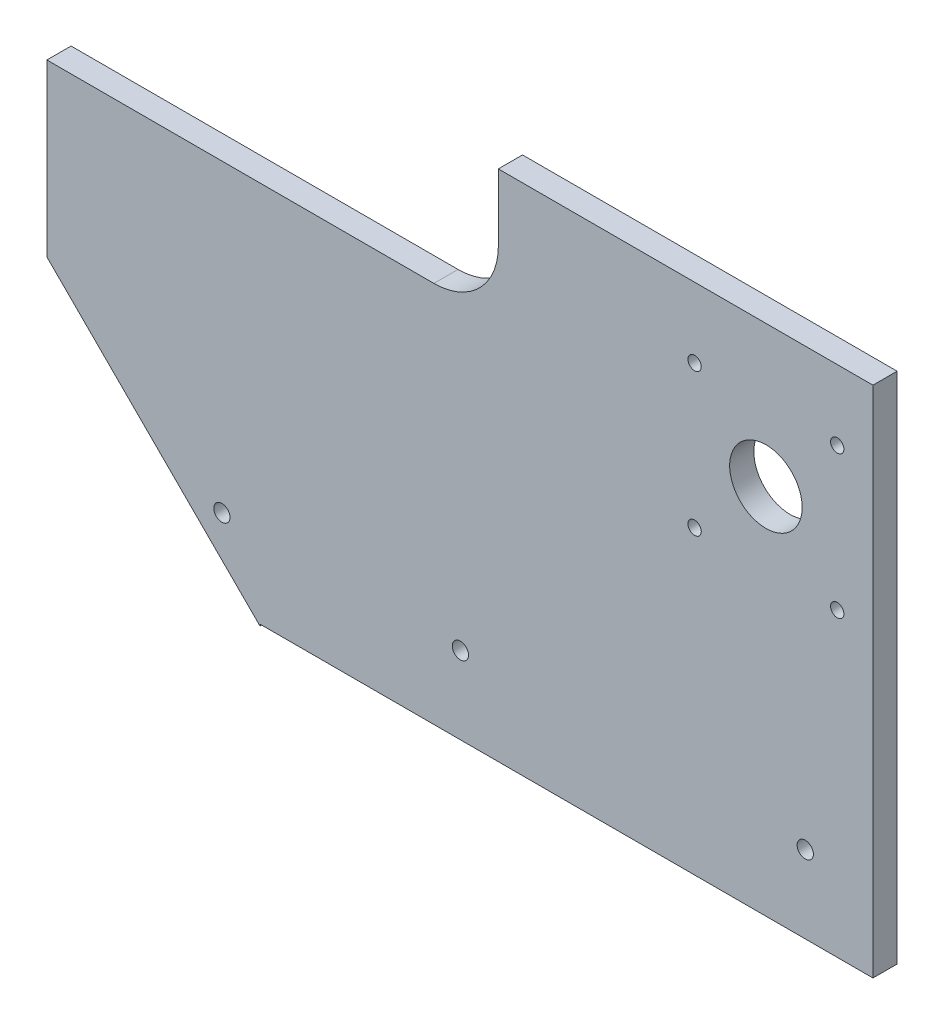
ISO-10303-21;
HEADER;
FILE_DESCRIPTION(('STEP AP214'),'2;1');
FILE_NAME('part.step','',(''),(''),'','','');
FILE_SCHEMA(('AUTOMOTIVE_DESIGN { 1 0 10303 214 1 1 1 1 }'));
ENDSEC;
DATA;
#1=APPLICATION_CONTEXT('core data for automotive mechanical design processes');
#2=APPLICATION_PROTOCOL_DEFINITION('international standard','automotive_design',2000,#1);
#3=PRODUCT_CONTEXT('',#1,'mechanical');
#4=PRODUCT('Part','Part','',(#3));
#5=PRODUCT_RELATED_PRODUCT_CATEGORY('part','',(#4));
#6=PRODUCT_DEFINITION_FORMATION('','',#4);
#7=PRODUCT_DEFINITION_CONTEXT('part definition',#1,'design');
#8=PRODUCT_DEFINITION('design','',#6,#7);
#9=PRODUCT_DEFINITION_SHAPE('','',#8);
#10=(LENGTH_UNIT() NAMED_UNIT(*) SI_UNIT(.MILLI.,.METRE.));
#11=(NAMED_UNIT(*) PLANE_ANGLE_UNIT() SI_UNIT($,.RADIAN.));
#12=(NAMED_UNIT(*) SI_UNIT($,.STERADIAN.) SOLID_ANGLE_UNIT());
#13=UNCERTAINTY_MEASURE_WITH_UNIT(LENGTH_MEASURE(1.E-05),#10,'distance_accuracy_value','');
#14=(GEOMETRIC_REPRESENTATION_CONTEXT(3) GLOBAL_UNCERTAINTY_ASSIGNED_CONTEXT((#13)) GLOBAL_UNIT_ASSIGNED_CONTEXT((#10,
#11,#12)) REPRESENTATION_CONTEXT('',''));
#15=CARTESIAN_POINT('',(0.,0.,0.));
#16=DIRECTION('',(0.,0.,1.));
#17=DIRECTION('',(1.,0.,0.));
#18=AXIS2_PLACEMENT_3D('',#15,#16,#17);
#19=CARTESIAN_POINT('',(0.,0.,9.525));
#20=DIRECTION('',(0.,0.,-1.));
#21=DIRECTION('',(-1.,0.,0.));
#22=AXIS2_PLACEMENT_3D('',#19,#20,#21);
#23=PLANE('',#22);
#24=CARTESIAN_POINT('',(196.040627804404,-39.3145242569465,9.525));
#25=DIRECTION('',(0.,0.,1.));
#26=DIRECTION('',(1.,0.,0.));
#27=AXIS2_PLACEMENT_3D('',#24,#25,#26);
#28=CIRCLE('',#27,3.20000000000001);
#29=CARTESIAN_POINT('',(199.240627804404,-39.3145242569465,9.525));
#30=VERTEX_POINT('',#29);
#31=EDGE_CURVE('E117',#30,#30,#28,.T.);
#32=ORIENTED_EDGE('',*,*,#31,.F.);
#33=EDGE_LOOP('',(#32));
#34=FACE_BOUND('',#33,.T.);
#35=CARTESIAN_POINT('',(60.1506278044037,-39.3145242569465,9.525));
#36=DIRECTION('',(0.,0.,1.));
#37=DIRECTION('',(1.,0.,0.));
#38=AXIS2_PLACEMENT_3D('',#35,#36,#37);
#39=CIRCLE('',#38,3.19999999999999);
#40=CARTESIAN_POINT('',(63.3506278044037,-39.3145242569465,9.525));
#41=VERTEX_POINT('',#40);
#42=EDGE_CURVE('E440',#41,#41,#39,.T.);
#43=ORIENTED_EDGE('',*,*,#42,.F.);
#44=EDGE_LOOP('',(#43));
#45=FACE_BOUND('',#44,.T.);
#46=CARTESIAN_POINT('',(-33.8293721955963,-39.3145242569465,9.525));
#47=DIRECTION('',(0.,0.,1.));
#48=DIRECTION('',(1.,0.,0.));
#49=AXIS2_PLACEMENT_3D('',#46,#47,#48);
#50=CIRCLE('',#49,3.2);
#51=CARTESIAN_POINT('',(-30.6293721955963,-39.3145242569465,9.525));
#52=VERTEX_POINT('',#51);
#53=EDGE_CURVE('E433',#52,#52,#50,.T.);
#54=ORIENTED_EDGE('',*,*,#53,.F.);
#55=EDGE_LOOP('',(#54));
#56=FACE_BOUND('',#55,.T.);
#57=CARTESIAN_POINT('',(208.638014077675,104.931975743054,9.525));
#58=DIRECTION('',(0.,0.,1.));
#59=DIRECTION('',(1.,0.,0.));
#60=AXIS2_PLACEMENT_3D('',#57,#58,#59);
#61=CIRCLE('',#60,2.62499999999999);
#62=CARTESIAN_POINT('',(211.263014077675,104.931975743054,9.525));
#63=VERTEX_POINT('',#62);
#64=EDGE_CURVE('E425',#63,#63,#61,.T.);
#65=ORIENTED_EDGE('',*,*,#64,.F.);
#66=EDGE_LOOP('',(#65));
#67=FACE_BOUND('',#66,.T.);
#68=CARTESIAN_POINT('',(152.438014077675,104.931975743054,9.525));
#69=DIRECTION('',(0.,0.,1.));
#70=DIRECTION('',(1.,0.,0.));
#71=AXIS2_PLACEMENT_3D('',#68,#69,#70);
#72=CIRCLE('',#71,2.62499999999999);
#73=CARTESIAN_POINT('',(155.063014077675,104.931975743054,9.525));
#74=VERTEX_POINT('',#73);
#75=EDGE_CURVE('E419',#74,#74,#72,.T.);
#76=ORIENTED_EDGE('',*,*,#75,.F.);
#77=EDGE_LOOP('',(#76));
#78=FACE_BOUND('',#77,.T.);
#79=CARTESIAN_POINT('',(152.438014077675,48.7319757430537,9.525));
#80=DIRECTION('',(0.,0.,1.));
#81=DIRECTION('',(1.,0.,0.));
#82=AXIS2_PLACEMENT_3D('',#79,#80,#81);
#83=CIRCLE('',#82,2.62499999999999);
#84=CARTESIAN_POINT('',(155.063014077675,48.7319757430537,9.525));
#85=VERTEX_POINT('',#84);
#86=EDGE_CURVE('E412',#85,#85,#83,.T.);
#87=ORIENTED_EDGE('',*,*,#86,.F.);
#88=EDGE_LOOP('',(#87));
#89=FACE_BOUND('',#88,.T.);
#90=CARTESIAN_POINT('',(208.638014077675,48.7319757430537,9.525));
#91=DIRECTION('',(0.,0.,1.));
#92=DIRECTION('',(1.,0.,0.));
#93=AXIS2_PLACEMENT_3D('',#90,#91,#92);
#94=CIRCLE('',#93,2.62499999999999);
#95=CARTESIAN_POINT('',(211.263014077675,48.7319757430537,9.525));
#96=VERTEX_POINT('',#95);
#97=EDGE_CURVE('E406',#96,#96,#94,.T.);
#98=ORIENTED_EDGE('',*,*,#97,.F.);
#99=EDGE_LOOP('',(#98));
#100=FACE_BOUND('',#99,.T.);
#101=CARTESIAN_POINT('',(180.538014077675,76.8319757430537,9.525));
#102=DIRECTION('',(0.,0.,1.));
#103=DIRECTION('',(1.,0.,0.));
#104=AXIS2_PLACEMENT_3D('',#101,#102,#103);
#105=CIRCLE('',#104,14.2875);
#106=CARTESIAN_POINT('',(194.825514077675,76.8319757430537,9.525));
#107=VERTEX_POINT('',#106);
#108=EDGE_CURVE('E148',#107,#107,#105,.T.);
#109=ORIENTED_EDGE('',*,*,#108,.F.);
#110=EDGE_LOOP('',(#109));
#111=FACE_BOUND('',#110,.T.);
#112=DIRECTION('',(1.,0.,0.));
#113=VECTOR('',#112,1.);
#114=CARTESIAN_POINT('',(-138.259383473898,80.7414870213568,9.525));
#115=LINE('',#114,#113);
#116=CARTESIAN_POINT('',(-102.790372195595,80.7414870213568,9.525));
#117=VERTEX_POINT('',#116);
#118=CARTESIAN_POINT('',(49.7006165261019,80.7414870213568,9.525));
#119=VERTEX_POINT('',#118);
#120=EDGE_CURVE('E125',#117,#119,#115,.T.);
#121=ORIENTED_EDGE('',*,*,#120,.F.);
#122=DIRECTION('',(0.,1.,0.));
#123=VECTOR('',#122,1.);
#124=CARTESIAN_POINT('',(-102.790372195595,145.085482825519,9.525));
#125=LINE('',#124,#123);
#126=CARTESIAN_POINT('',(-102.790372195595,13.5224757430543,9.525));
#127=VERTEX_POINT('',#126);
#128=EDGE_CURVE('E54',#127,#117,#125,.T.);
#129=ORIENTED_EDGE('',*,*,#128,.F.);
#130=DIRECTION('',(0.707106781186546,-0.707106781186549,0.));
#131=VECTOR('',#130,1.);
#132=CARTESIAN_POINT('',(-138.259383473898,48.9914870213571,9.525));
#133=LINE('',#132,#131);
#134=CARTESIAN_POINT('',(-18.8122502523257,-70.4556462002152,9.525));
#135=VERTEX_POINT('',#134);
#136=EDGE_CURVE('E122',#127,#135,#133,.T.);
#137=ORIENTED_EDGE('',*,*,#136,.T.);
#138=DIRECTION('',(0.,1.,0.));
#139=VECTOR('',#138,1.);
#140=CARTESIAN_POINT('',(-18.8122502523257,-121.478524256947,9.525));
#141=LINE('',#140,#139);
#142=CARTESIAN_POINT('',(-18.8122502523257,-69.7895242562747,9.525));
#143=VERTEX_POINT('',#142);
#144=EDGE_CURVE('E180',#135,#143,#141,.T.);
#145=ORIENTED_EDGE('',*,*,#144,.T.);
#146=DIRECTION('',(-1.,0.,0.));
#147=VECTOR('',#146,1.);
#148=CARTESIAN_POINT('',(241.760627804405,-69.7895242562763,9.525));
#149=LINE('',#148,#147);
#150=CARTESIAN_POINT('',(222.710627804405,-69.7895242562762,9.525));
#151=VERTEX_POINT('',#150);
#152=EDGE_CURVE('E178',#151,#143,#149,.T.);
#153=ORIENTED_EDGE('',*,*,#152,.F.);
#154=DIRECTION('',(0.,1.,0.));
#155=VECTOR('',#154,1.);
#156=CARTESIAN_POINT('',(222.710627804405,-121.478524256948,9.525));
#157=LINE('',#156,#155);
#158=CARTESIAN_POINT('',(222.710627804405,132.521475743053,9.525));
#159=VERTEX_POINT('',#158);
#160=EDGE_CURVE('E132',#151,#159,#157,.T.);
#161=ORIENTED_EDGE('',*,*,#160,.T.);
#162=DIRECTION('',(-1.,0.,0.));
#163=VECTOR('',#162,1.);
#164=CARTESIAN_POINT('',(75.1006165261018,132.521475743053,9.525));
#165=LINE('',#164,#163);
#166=CARTESIAN_POINT('',(75.1006165261018,132.521475743053,9.525));
#167=VERTEX_POINT('',#166);
#168=EDGE_CURVE('E389',#159,#167,#165,.T.);
#169=ORIENTED_EDGE('',*,*,#168,.T.);
#170=DIRECTION('',(0.,-1.,0.));
#171=VECTOR('',#170,1.);
#172=CARTESIAN_POINT('',(75.1006165261018,149.508839023054,9.525));
#173=LINE('',#172,#171);
#174=CARTESIAN_POINT('',(75.1006165261018,106.141487021357,9.525));
#175=VERTEX_POINT('',#174);
#176=EDGE_CURVE('E176',#167,#175,#173,.T.);
#177=ORIENTED_EDGE('',*,*,#176,.T.);
#178=CARTESIAN_POINT('',(49.7006165261018,106.141487021357,9.525));
#179=DIRECTION('',(0.,0.,-1.));
#180=DIRECTION('',(-1.,0.,0.));
#181=AXIS2_PLACEMENT_3D('',#178,#179,#180);
#182=CIRCLE('',#181,25.4);
#183=EDGE_CURVE('E159',#175,#119,#182,.T.);
#184=ORIENTED_EDGE('',*,*,#183,.T.);
#185=EDGE_LOOP('',(#121,#129,#137,#145,#153,#161,#169,#177,#184));
#186=FACE_BOUND('',#185,.T.);
#187=ADVANCED_FACE('F39',(#34,#45,#56,#67,#78,#89,#100,#111,#186),#23,.F.);
#188=CARTESIAN_POINT('',(0.,0.,0.));
#189=DIRECTION('',(0.,0.,-1.));
#190=DIRECTION('',(-1.,0.,0.));
#191=AXIS2_PLACEMENT_3D('',#188,#189,#190);
#192=PLANE('',#191);
#193=DIRECTION('',(0.,1.,0.));
#194=VECTOR('',#193,1.);
#195=CARTESIAN_POINT('',(-102.790372195595,145.085482825519,0.));
#196=LINE('',#195,#194);
#197=CARTESIAN_POINT('',(-102.790372195595,13.5224757430543,0.));
#198=VERTEX_POINT('',#197);
#199=CARTESIAN_POINT('',(-102.790372195595,80.7414870213568,0.));
#200=VERTEX_POINT('',#199);
#201=EDGE_CURVE('E113',#198,#200,#196,.T.);
#202=ORIENTED_EDGE('',*,*,#201,.T.);
#203=DIRECTION('',(1.,0.,0.));
#204=VECTOR('',#203,1.);
#205=CARTESIAN_POINT('',(-138.259383473898,80.7414870213568,0.));
#206=LINE('',#205,#204);
#207=CARTESIAN_POINT('',(49.7006165261019,80.7414870213568,0.));
#208=VERTEX_POINT('',#207);
#209=EDGE_CURVE('E169',#200,#208,#206,.T.);
#210=ORIENTED_EDGE('',*,*,#209,.T.);
#211=CARTESIAN_POINT('',(49.7006165261018,106.141487021357,0.));
#212=DIRECTION('',(0.,0.,-1.));
#213=DIRECTION('',(-1.,0.,0.));
#214=AXIS2_PLACEMENT_3D('',#211,#212,#213);
#215=CIRCLE('',#214,25.4);
#216=CARTESIAN_POINT('',(75.1006165261018,106.141487021357,0.));
#217=VERTEX_POINT('',#216);
#218=EDGE_CURVE('E47',#208,#217,#215,.F.);
#219=ORIENTED_EDGE('',*,*,#218,.T.);
#220=DIRECTION('',(0.,-1.,0.));
#221=VECTOR('',#220,1.);
#222=CARTESIAN_POINT('',(75.1006165261018,149.508839023054,0.));
#223=LINE('',#222,#221);
#224=CARTESIAN_POINT('',(75.1006165261018,132.521475743053,0.));
#225=VERTEX_POINT('',#224);
#226=EDGE_CURVE('E167',#225,#217,#223,.T.);
#227=ORIENTED_EDGE('',*,*,#226,.F.);
#228=DIRECTION('',(-1.,0.,0.));
#229=VECTOR('',#228,1.);
#230=CARTESIAN_POINT('',(75.1006165261018,132.521475743053,0.));
#231=LINE('',#230,#229);
#232=CARTESIAN_POINT('',(222.710627804405,132.521475743053,0.));
#233=VERTEX_POINT('',#232);
#234=EDGE_CURVE('E61',#233,#225,#231,.T.);
#235=ORIENTED_EDGE('',*,*,#234,.F.);
#236=DIRECTION('',(0.,1.,0.));
#237=VECTOR('',#236,1.);
#238=CARTESIAN_POINT('',(222.710627804405,-121.478524256948,0.));
#239=LINE('',#238,#237);
#240=CARTESIAN_POINT('',(222.710627804405,-69.7895242562762,0.));
#241=VERTEX_POINT('',#240);
#242=EDGE_CURVE('E145',#241,#233,#239,.T.);
#243=ORIENTED_EDGE('',*,*,#242,.F.);
#244=DIRECTION('',(-1.,0.,0.));
#245=VECTOR('',#244,1.);
#246=CARTESIAN_POINT('',(241.760627804405,-69.7895242562763,0.));
#247=LINE('',#246,#245);
#248=CARTESIAN_POINT('',(-18.8122502523257,-69.7895242562747,0.));
#249=VERTEX_POINT('',#248);
#250=EDGE_CURVE('E187',#241,#249,#247,.T.);
#251=ORIENTED_EDGE('',*,*,#250,.T.);
#252=DIRECTION('',(0.,1.,0.));
#253=VECTOR('',#252,1.);
#254=CARTESIAN_POINT('',(-18.8122502523257,-121.478524256947,0.));
#255=LINE('',#254,#253);
#256=CARTESIAN_POINT('',(-18.8122502523257,-70.4556462002153,0.));
#257=VERTEX_POINT('',#256);
#258=EDGE_CURVE('E191',#257,#249,#255,.T.);
#259=ORIENTED_EDGE('',*,*,#258,.F.);
#260=DIRECTION('',(0.707106781186546,-0.707106781186549,0.));
#261=VECTOR('',#260,1.);
#262=CARTESIAN_POINT('',(-138.259383473898,48.9914870213571,0.));
#263=LINE('',#262,#261);
#264=EDGE_CURVE('E141',#198,#257,#263,.T.);
#265=ORIENTED_EDGE('',*,*,#264,.F.);
#266=EDGE_LOOP('',(#202,#210,#219,#227,#235,#243,#251,#259,#265));
#267=FACE_BOUND('',#266,.T.);
#268=CARTESIAN_POINT('',(196.040627804404,-39.3145242569465,0.));
#269=DIRECTION('',(0.,0.,1.));
#270=DIRECTION('',(1.,0.,0.));
#271=AXIS2_PLACEMENT_3D('',#268,#269,#270);
#272=CIRCLE('',#271,3.20000000000001);
#273=CARTESIAN_POINT('',(199.240627804404,-39.3145242569465,0.));
#274=VERTEX_POINT('',#273);
#275=EDGE_CURVE('E443',#274,#274,#272,.T.);
#276=ORIENTED_EDGE('',*,*,#275,.T.);
#277=EDGE_LOOP('',(#276));
#278=FACE_BOUND('',#277,.T.);
#279=CARTESIAN_POINT('',(60.1506278044037,-39.3145242569465,0.));
#280=DIRECTION('',(0.,0.,1.));
#281=DIRECTION('',(1.,0.,0.));
#282=AXIS2_PLACEMENT_3D('',#279,#280,#281);
#283=CIRCLE('',#282,3.19999999999999);
#284=CARTESIAN_POINT('',(63.3506278044037,-39.3145242569465,0.));
#285=VERTEX_POINT('',#284);
#286=EDGE_CURVE('E436',#285,#285,#283,.T.);
#287=ORIENTED_EDGE('',*,*,#286,.T.);
#288=EDGE_LOOP('',(#287));
#289=FACE_BOUND('',#288,.T.);
#290=CARTESIAN_POINT('',(-33.8293721955963,-39.3145242569465,0.));
#291=DIRECTION('',(0.,0.,1.));
#292=DIRECTION('',(1.,0.,0.));
#293=AXIS2_PLACEMENT_3D('',#290,#291,#292);
#294=CIRCLE('',#293,3.2);
#295=CARTESIAN_POINT('',(-30.6293721955963,-39.3145242569465,0.));
#296=VERTEX_POINT('',#295);
#297=EDGE_CURVE('E429',#296,#296,#294,.T.);
#298=ORIENTED_EDGE('',*,*,#297,.T.);
#299=EDGE_LOOP('',(#298));
#300=FACE_BOUND('',#299,.T.);
#301=CARTESIAN_POINT('',(208.638014077675,104.931975743054,0.));
#302=DIRECTION('',(0.,0.,1.));
#303=DIRECTION('',(1.,0.,0.));
#304=AXIS2_PLACEMENT_3D('',#301,#302,#303);
#305=CIRCLE('',#304,2.62499999999999);
#306=CARTESIAN_POINT('',(211.263014077675,104.931975743054,0.));
#307=VERTEX_POINT('',#306);
#308=EDGE_CURVE('E422',#307,#307,#305,.T.);
#309=ORIENTED_EDGE('',*,*,#308,.T.);
#310=EDGE_LOOP('',(#309));
#311=FACE_BOUND('',#310,.T.);
#312=CARTESIAN_POINT('',(152.438014077675,104.931975743054,0.));
#313=DIRECTION('',(0.,0.,1.));
#314=DIRECTION('',(1.,0.,0.));
#315=AXIS2_PLACEMENT_3D('',#312,#313,#314);
#316=CIRCLE('',#315,2.62499999999999);
#317=CARTESIAN_POINT('',(155.063014077675,104.931975743054,0.));
#318=VERTEX_POINT('',#317);
#319=EDGE_CURVE('E416',#318,#318,#316,.T.);
#320=ORIENTED_EDGE('',*,*,#319,.T.);
#321=EDGE_LOOP('',(#320));
#322=FACE_BOUND('',#321,.T.);
#323=CARTESIAN_POINT('',(152.438014077675,48.7319757430537,0.));
#324=DIRECTION('',(0.,0.,1.));
#325=DIRECTION('',(1.,0.,0.));
#326=AXIS2_PLACEMENT_3D('',#323,#324,#325);
#327=CIRCLE('',#326,2.62499999999999);
#328=CARTESIAN_POINT('',(155.063014077675,48.7319757430537,0.));
#329=VERTEX_POINT('',#328);
#330=EDGE_CURVE('E409',#329,#329,#327,.T.);
#331=ORIENTED_EDGE('',*,*,#330,.T.);
#332=EDGE_LOOP('',(#331));
#333=FACE_BOUND('',#332,.T.);
#334=CARTESIAN_POINT('',(208.638014077675,48.7319757430537,0.));
#335=DIRECTION('',(0.,0.,1.));
#336=DIRECTION('',(1.,0.,0.));
#337=AXIS2_PLACEMENT_3D('',#334,#335,#336);
#338=CIRCLE('',#337,2.62499999999999);
#339=CARTESIAN_POINT('',(211.263014077675,48.7319757430537,0.));
#340=VERTEX_POINT('',#339);
#341=EDGE_CURVE('E400',#340,#340,#338,.T.);
#342=ORIENTED_EDGE('',*,*,#341,.T.);
#343=EDGE_LOOP('',(#342));
#344=FACE_BOUND('',#343,.T.);
#345=CARTESIAN_POINT('',(180.538014077675,76.8319757430537,0.));
#346=DIRECTION('',(0.,0.,1.));
#347=DIRECTION('',(1.,0.,0.));
#348=AXIS2_PLACEMENT_3D('',#345,#346,#347);
#349=CIRCLE('',#348,14.2875);
#350=CARTESIAN_POINT('',(194.825514077675,76.8319757430537,0.));
#351=VERTEX_POINT('',#350);
#352=EDGE_CURVE('E199',#351,#351,#349,.T.);
#353=ORIENTED_EDGE('',*,*,#352,.T.);
#354=EDGE_LOOP('',(#353));
#355=FACE_BOUND('',#354,.T.);
#356=ADVANCED_FACE('F165',(#267,#278,#289,#300,#311,#322,#333,#344,#355),#192,.T.);
#357=CARTESIAN_POINT('',(-138.259383473898,48.9914870213571,9.525));
#358=DIRECTION('',(0.707106781186549,0.707106781186546,0.));
#359=DIRECTION('',(-0.707106781186546,0.707106781186549,0.));
#360=AXIS2_PLACEMENT_3D('',#357,#358,#359);
#361=PLANE('',#360);
#362=ORIENTED_EDGE('',*,*,#136,.F.);
#363=DIRECTION('',(0.,0.,-1.));
#364=VECTOR('',#363,1.);
#365=CARTESIAN_POINT('',(-102.790372195595,13.5224757430543,9.525));
#366=LINE('',#365,#364);
#367=EDGE_CURVE('E110',#127,#198,#366,.T.);
#368=ORIENTED_EDGE('',*,*,#367,.T.);
#369=ORIENTED_EDGE('',*,*,#264,.T.);
#370=DIRECTION('',(0.,0.,-1.));
#371=VECTOR('',#370,1.);
#372=CARTESIAN_POINT('',(-18.8122502523257,-70.4556462002152,9.525));
#373=LINE('',#372,#371);
#374=EDGE_CURVE('E130',#135,#257,#373,.T.);
#375=ORIENTED_EDGE('',*,*,#374,.F.);
#376=EDGE_LOOP('',(#362,#368,#369,#375));
#377=FACE_BOUND('',#376,.T.);
#378=ADVANCED_FACE('F128',(#377),#361,.F.);
#379=CARTESIAN_POINT('',(222.710627804405,-121.478524256948,9.525));
#380=DIRECTION('',(-1.,0.,0.));
#381=DIRECTION('',(0.,-1.,0.));
#382=AXIS2_PLACEMENT_3D('',#379,#380,#381);
#383=PLANE('',#382);
#384=ORIENTED_EDGE('',*,*,#242,.T.);
#385=DIRECTION('',(0.,0.,-1.));
#386=VECTOR('',#385,1.);
#387=CARTESIAN_POINT('',(222.710627804405,132.521475743053,9.525));
#388=LINE('',#387,#386);
#389=EDGE_CURVE('E394',#159,#233,#388,.T.);
#390=ORIENTED_EDGE('',*,*,#389,.F.);
#391=ORIENTED_EDGE('',*,*,#160,.F.);
#392=DIRECTION('',(0.,0.,-1.));
#393=VECTOR('',#392,1.);
#394=CARTESIAN_POINT('',(222.710627804405,-69.7895242562762,9.525));
#395=LINE('',#394,#393);
#396=EDGE_CURVE('E137',#151,#241,#395,.T.);
#397=ORIENTED_EDGE('',*,*,#396,.T.);
#398=EDGE_LOOP('',(#384,#390,#391,#397));
#399=FACE_BOUND('',#398,.T.);
#400=ADVANCED_FACE('F210',(#399),#383,.F.);
#401=CARTESIAN_POINT('',(180.538014077675,76.8319757430537,9.525));
#402=DIRECTION('',(0.,0.,-1.));
#403=DIRECTION('',(-1.,0.,0.));
#404=AXIS2_PLACEMENT_3D('',#401,#402,#403);
#405=CYLINDRICAL_SURFACE('',#404,14.2875);
#406=ORIENTED_EDGE('',*,*,#108,.T.);
#407=EDGE_LOOP('',(#406));
#408=FACE_BOUND('',#407,.T.);
#409=ORIENTED_EDGE('',*,*,#352,.F.);
#410=EDGE_LOOP('',(#409));
#411=FACE_BOUND('',#410,.T.);
#412=ADVANCED_FACE('F207',(#408,#411),#405,.F.);
#413=CARTESIAN_POINT('',(241.760627804405,-69.7895242562763,0.));
#414=DIRECTION('',(0.,1.,0.));
#415=DIRECTION('',(-1.,0.,0.));
#416=AXIS2_PLACEMENT_3D('',#413,#414,#415);
#417=PLANE('',#416);
#418=ORIENTED_EDGE('',*,*,#152,.T.);
#419=DIRECTION('',(0.,0.,1.));
#420=VECTOR('',#419,1.);
#421=CARTESIAN_POINT('',(-18.8122502523257,-69.7895242562747,0.));
#422=LINE('',#421,#420);
#423=EDGE_CURVE('E193',#249,#143,#422,.T.);
#424=ORIENTED_EDGE('',*,*,#423,.F.);
#425=ORIENTED_EDGE('',*,*,#250,.F.);
#426=ORIENTED_EDGE('',*,*,#396,.F.);
#427=EDGE_LOOP('',(#418,#424,#425,#426));
#428=FACE_BOUND('',#427,.T.);
#429=ADVANCED_FACE('F209',(#428),#417,.F.);
#430=CARTESIAN_POINT('',(-18.8122502523257,-121.478524256947,0.));
#431=DIRECTION('',(1.,0.,0.));
#432=DIRECTION('',(0.,0.,-1.));
#433=AXIS2_PLACEMENT_3D('',#430,#431,#432);
#434=PLANE('',#433);
#435=ORIENTED_EDGE('',*,*,#374,.T.);
#436=ORIENTED_EDGE('',*,*,#258,.T.);
#437=ORIENTED_EDGE('',*,*,#423,.T.);
#438=ORIENTED_EDGE('',*,*,#144,.F.);
#439=EDGE_LOOP('',(#435,#436,#437,#438));
#440=FACE_BOUND('',#439,.T.);
#441=ADVANCED_FACE('F217',(#440),#434,.T.);
#442=CARTESIAN_POINT('',(75.1006165261018,149.508839023054,0.));
#443=DIRECTION('',(-1.,0.,0.));
#444=DIRECTION('',(0.,0.,1.));
#445=AXIS2_PLACEMENT_3D('',#442,#443,#444);
#446=PLANE('',#445);
#447=DIRECTION('',(0.,0.,-1.));
#448=VECTOR('',#447,1.);
#449=CARTESIAN_POINT('',(75.1006165261018,132.521475743053,9.525));
#450=LINE('',#449,#448);
#451=EDGE_CURVE('E177',#167,#225,#450,.T.);
#452=ORIENTED_EDGE('',*,*,#451,.T.);
#453=ORIENTED_EDGE('',*,*,#226,.T.);
#454=DIRECTION('',(0.,0.,1.));
#455=VECTOR('',#454,1.);
#456=CARTESIAN_POINT('',(75.1006165261018,106.141487021357,0.));
#457=LINE('',#456,#455);
#458=EDGE_CURVE('E156',#217,#175,#457,.T.);
#459=ORIENTED_EDGE('',*,*,#458,.T.);
#460=ORIENTED_EDGE('',*,*,#176,.F.);
#461=EDGE_LOOP('',(#452,#453,#459,#460));
#462=FACE_BOUND('',#461,.T.);
#463=ADVANCED_FACE('F175',(#462),#446,.T.);
#464=CARTESIAN_POINT('',(-138.259383473898,80.7414870213568,0.));
#465=DIRECTION('',(0.,-1.,0.));
#466=DIRECTION('',(0.,0.,-1.));
#467=AXIS2_PLACEMENT_3D('',#464,#465,#466);
#468=PLANE('',#467);
#469=ORIENTED_EDGE('',*,*,#209,.F.);
#470=DIRECTION('',(0.,0.,1.));
#471=VECTOR('',#470,1.);
#472=CARTESIAN_POINT('',(-102.790372195595,80.7414870213568,0.));
#473=LINE('',#472,#471);
#474=EDGE_CURVE('E11',#200,#117,#473,.T.);
#475=ORIENTED_EDGE('',*,*,#474,.T.);
#476=ORIENTED_EDGE('',*,*,#120,.T.);
#477=DIRECTION('',(0.,0.,1.));
#478=VECTOR('',#477,1.);
#479=CARTESIAN_POINT('',(49.7006165261019,80.7414870213568,0.));
#480=LINE('',#479,#478);
#481=EDGE_CURVE('E153',#119,#208,#480,.F.);
#482=ORIENTED_EDGE('',*,*,#481,.T.);
#483=EDGE_LOOP('',(#469,#475,#476,#482));
#484=FACE_BOUND('',#483,.T.);
#485=ADVANCED_FACE('F257',(#484),#468,.F.);
#486=CARTESIAN_POINT('',(49.7006165261018,106.141487021357,0.));
#487=DIRECTION('',(0.,0.,1.));
#488=DIRECTION('',(1.,0.,0.));
#489=AXIS2_PLACEMENT_3D('',#486,#487,#488);
#490=CYLINDRICAL_SURFACE('',#489,25.4);
#491=ORIENTED_EDGE('',*,*,#218,.F.);
#492=ORIENTED_EDGE('',*,*,#481,.F.);
#493=ORIENTED_EDGE('',*,*,#183,.F.);
#494=ORIENTED_EDGE('',*,*,#458,.F.);
#495=EDGE_LOOP('',(#491,#492,#493,#494));
#496=FACE_BOUND('',#495,.T.);
#497=ADVANCED_FACE('F41',(#496),#490,.F.);
#498=CARTESIAN_POINT('',(75.1006165261018,132.521475743053,9.525));
#499=DIRECTION('',(0.,-1.,0.));
#500=DIRECTION('',(0.,0.,-1.));
#501=AXIS2_PLACEMENT_3D('',#498,#499,#500);
#502=PLANE('',#501);
#503=ORIENTED_EDGE('',*,*,#234,.T.);
#504=ORIENTED_EDGE('',*,*,#451,.F.);
#505=ORIENTED_EDGE('',*,*,#168,.F.);
#506=ORIENTED_EDGE('',*,*,#389,.T.);
#507=EDGE_LOOP('',(#503,#504,#505,#506));
#508=FACE_BOUND('',#507,.T.);
#509=ADVANCED_FACE('F266',(#508),#502,.F.);
#510=CARTESIAN_POINT('',(208.638014077675,48.7319757430537,9.525));
#511=DIRECTION('',(0.,0.,1.));
#512=DIRECTION('',(1.,0.,0.));
#513=AXIS2_PLACEMENT_3D('',#510,#511,#512);
#514=CYLINDRICAL_SURFACE('',#513,2.62499999999999);
#515=ORIENTED_EDGE('',*,*,#341,.F.);
#516=EDGE_LOOP('',(#515));
#517=FACE_BOUND('',#516,.T.);
#518=ORIENTED_EDGE('',*,*,#97,.T.);
#519=EDGE_LOOP('',(#518));
#520=FACE_BOUND('',#519,.T.);
#521=ADVANCED_FACE('F272',(#517,#520),#514,.F.);
#522=CARTESIAN_POINT('',(152.438014077675,48.7319757430537,9.525));
#523=DIRECTION('',(0.,0.,1.));
#524=DIRECTION('',(1.,0.,0.));
#525=AXIS2_PLACEMENT_3D('',#522,#523,#524);
#526=CYLINDRICAL_SURFACE('',#525,2.62499999999999);
#527=ORIENTED_EDGE('',*,*,#330,.F.);
#528=EDGE_LOOP('',(#527));
#529=FACE_BOUND('',#528,.T.);
#530=ORIENTED_EDGE('',*,*,#86,.T.);
#531=EDGE_LOOP('',(#530));
#532=FACE_BOUND('',#531,.T.);
#533=ADVANCED_FACE('F280',(#529,#532),#526,.F.);
#534=CARTESIAN_POINT('',(152.438014077675,104.931975743054,9.525));
#535=DIRECTION('',(0.,0.,1.));
#536=DIRECTION('',(1.,0.,0.));
#537=AXIS2_PLACEMENT_3D('',#534,#535,#536);
#538=CYLINDRICAL_SURFACE('',#537,2.62499999999999);
#539=ORIENTED_EDGE('',*,*,#319,.F.);
#540=EDGE_LOOP('',(#539));
#541=FACE_BOUND('',#540,.T.);
#542=ORIENTED_EDGE('',*,*,#75,.T.);
#543=EDGE_LOOP('',(#542));
#544=FACE_BOUND('',#543,.T.);
#545=ADVANCED_FACE('F290',(#541,#544),#538,.F.);
#546=CARTESIAN_POINT('',(208.638014077675,104.931975743054,9.525));
#547=DIRECTION('',(0.,0.,1.));
#548=DIRECTION('',(1.,0.,0.));
#549=AXIS2_PLACEMENT_3D('',#546,#547,#548);
#550=CYLINDRICAL_SURFACE('',#549,2.62499999999999);
#551=ORIENTED_EDGE('',*,*,#308,.F.);
#552=EDGE_LOOP('',(#551));
#553=FACE_BOUND('',#552,.T.);
#554=ORIENTED_EDGE('',*,*,#64,.T.);
#555=EDGE_LOOP('',(#554));
#556=FACE_BOUND('',#555,.T.);
#557=ADVANCED_FACE('F300',(#553,#556),#550,.F.);
#558=CARTESIAN_POINT('',(-33.8293721955963,-39.3145242569465,9.525));
#559=DIRECTION('',(0.,0.,1.));
#560=DIRECTION('',(1.,0.,0.));
#561=AXIS2_PLACEMENT_3D('',#558,#559,#560);
#562=CYLINDRICAL_SURFACE('',#561,3.2);
#563=ORIENTED_EDGE('',*,*,#297,.F.);
#564=EDGE_LOOP('',(#563));
#565=FACE_BOUND('',#564,.T.);
#566=ORIENTED_EDGE('',*,*,#53,.T.);
#567=EDGE_LOOP('',(#566));
#568=FACE_BOUND('',#567,.T.);
#569=ADVANCED_FACE('F310',(#565,#568),#562,.F.);
#570=CARTESIAN_POINT('',(60.1506278044037,-39.3145242569465,9.525));
#571=DIRECTION('',(0.,0.,1.));
#572=DIRECTION('',(1.,0.,0.));
#573=AXIS2_PLACEMENT_3D('',#570,#571,#572);
#574=CYLINDRICAL_SURFACE('',#573,3.19999999999999);
#575=ORIENTED_EDGE('',*,*,#286,.F.);
#576=EDGE_LOOP('',(#575));
#577=FACE_BOUND('',#576,.T.);
#578=ORIENTED_EDGE('',*,*,#42,.T.);
#579=EDGE_LOOP('',(#578));
#580=FACE_BOUND('',#579,.T.);
#581=ADVANCED_FACE('F320',(#577,#580),#574,.F.);
#582=CARTESIAN_POINT('',(196.040627804404,-39.3145242569465,9.525));
#583=DIRECTION('',(0.,0.,1.));
#584=DIRECTION('',(1.,0.,0.));
#585=AXIS2_PLACEMENT_3D('',#582,#583,#584);
#586=CYLINDRICAL_SURFACE('',#585,3.20000000000001);
#587=ORIENTED_EDGE('',*,*,#275,.F.);
#588=EDGE_LOOP('',(#587));
#589=FACE_BOUND('',#588,.T.);
#590=ORIENTED_EDGE('',*,*,#31,.T.);
#591=EDGE_LOOP('',(#590));
#592=FACE_BOUND('',#591,.T.);
#593=ADVANCED_FACE('F330',(#589,#592),#586,.F.);
#594=CARTESIAN_POINT('',(-102.790372195595,145.085482825519,0.));
#595=DIRECTION('',(1.,0.,0.));
#596=DIRECTION('',(0.,1.,0.));
#597=AXIS2_PLACEMENT_3D('',#594,#595,#596);
#598=PLANE('',#597);
#599=ORIENTED_EDGE('',*,*,#128,.T.);
#600=ORIENTED_EDGE('',*,*,#474,.F.);
#601=ORIENTED_EDGE('',*,*,#201,.F.);
#602=ORIENTED_EDGE('',*,*,#367,.F.);
#603=EDGE_LOOP('',(#599,#600,#601,#602));
#604=FACE_BOUND('',#603,.T.);
#605=ADVANCED_FACE('F111',(#604),#598,.F.);
#606=CLOSED_SHELL('',(#187,#356,#378,#400,#412,#429,#441,#463,#485,#497,#509,#521,#533,#545,
#557,#569,#581,#593,#605));
#607=MANIFOLD_SOLID_BREP('B2',#606);
#608=ADVANCED_BREP_SHAPE_REPRESENTATION('',(#18,#607),#14);
#609=SHAPE_DEFINITION_REPRESENTATION(#9,#608);
ENDSEC;
END-ISO-10303-21;
